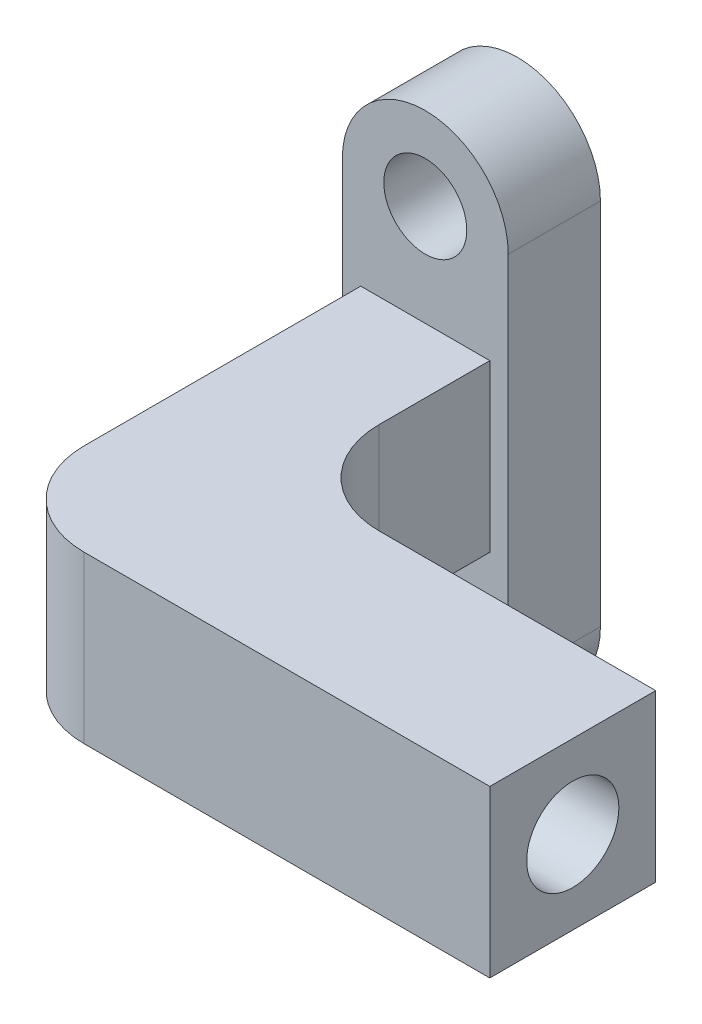
ISO-10303-21;
HEADER;
FILE_DESCRIPTION(('STEP AP214'),'2;1');
FILE_NAME('part.step','',(''),(''),'','','');
FILE_SCHEMA(('AUTOMOTIVE_DESIGN { 1 0 10303 214 1 1 1 1 }'));
ENDSEC;
DATA;
#1=APPLICATION_CONTEXT('core data for automotive mechanical design processes');
#2=APPLICATION_PROTOCOL_DEFINITION('international standard','automotive_design',2000,#1);
#3=PRODUCT_CONTEXT('',#1,'mechanical');
#4=PRODUCT('Part','Part','',(#3));
#5=PRODUCT_RELATED_PRODUCT_CATEGORY('part','',(#4));
#6=PRODUCT_DEFINITION_FORMATION('','',#4);
#7=PRODUCT_DEFINITION_CONTEXT('part definition',#1,'design');
#8=PRODUCT_DEFINITION('design','',#6,#7);
#9=PRODUCT_DEFINITION_SHAPE('','',#8);
#10=(LENGTH_UNIT() NAMED_UNIT(*) SI_UNIT(.MILLI.,.METRE.));
#11=(NAMED_UNIT(*) PLANE_ANGLE_UNIT() SI_UNIT($,.RADIAN.));
#12=(NAMED_UNIT(*) SI_UNIT($,.STERADIAN.) SOLID_ANGLE_UNIT());
#13=UNCERTAINTY_MEASURE_WITH_UNIT(LENGTH_MEASURE(1.E-05),#10,'distance_accuracy_value','');
#14=(GEOMETRIC_REPRESENTATION_CONTEXT(3) GLOBAL_UNCERTAINTY_ASSIGNED_CONTEXT((#13)) GLOBAL_UNIT_ASSIGNED_CONTEXT((#10,
#11,#12)) REPRESENTATION_CONTEXT('',''));
#15=CARTESIAN_POINT('',(0.,0.,0.));
#16=DIRECTION('',(0.,0.,1.));
#17=DIRECTION('',(1.,0.,0.));
#18=AXIS2_PLACEMENT_3D('',#15,#16,#17);
#19=CARTESIAN_POINT('',(3.5,-4.5,25.));
#20=DIRECTION('',(-1.,0.,0.));
#21=DIRECTION('',(0.,0.,1.));
#22=AXIS2_PLACEMENT_3D('',#19,#20,#21);
#23=PLANE('',#22);
#24=DIRECTION('',(0.,0.,-1.));
#25=VECTOR('',#24,1.);
#26=CARTESIAN_POINT('',(3.5,4.5,25.));
#27=LINE('',#26,#25);
#28=CARTESIAN_POINT('',(3.5,4.5,11.));
#29=VERTEX_POINT('',#28);
#30=CARTESIAN_POINT('',(3.5,4.5,5.));
#31=VERTEX_POINT('',#30);
#32=EDGE_CURVE('E223',#29,#31,#27,.T.);
#33=ORIENTED_EDGE('',*,*,#32,.F.);
#34=DIRECTION('',(0.,1.,0.));
#35=VECTOR('',#34,1.);
#36=CARTESIAN_POINT('',(3.5,-4.5,11.));
#37=LINE('',#36,#35);
#38=CARTESIAN_POINT('',(3.5,-4.5,11.));
#39=VERTEX_POINT('',#38);
#40=EDGE_CURVE('E272',#29,#39,#37,.F.);
#41=ORIENTED_EDGE('',*,*,#40,.T.);
#42=DIRECTION('',(0.,0.,-1.));
#43=VECTOR('',#42,1.);
#44=CARTESIAN_POINT('',(3.5,-4.5,25.));
#45=LINE('',#44,#43);
#46=CARTESIAN_POINT('',(3.5,-4.5,5.));
#47=VERTEX_POINT('',#46);
#48=EDGE_CURVE('E176',#39,#47,#45,.T.);
#49=ORIENTED_EDGE('',*,*,#48,.T.);
#50=DIRECTION('',(0.,1.,0.));
#51=VECTOR('',#50,1.);
#52=CARTESIAN_POINT('',(3.5,-4.5,5.));
#53=LINE('',#52,#51);
#54=EDGE_CURVE('E205',#47,#31,#53,.T.);
#55=ORIENTED_EDGE('',*,*,#54,.T.);
#56=EDGE_LOOP('',(#33,#41,#49,#55));
#57=FACE_BOUND('',#56,.T.);
#58=ADVANCED_FACE('F81',(#57),#23,.F.);
#59=CARTESIAN_POINT('',(0.,-10.,5.));
#60=DIRECTION('',(0.,0.,-1.));
#61=DIRECTION('',(-1.,0.,0.));
#62=AXIS2_PLACEMENT_3D('',#59,#60,#61);
#63=CYLINDRICAL_SURFACE('',#62,2.25);
#64=CARTESIAN_POINT('',(0.,-10.,5.));
#65=DIRECTION('',(0.,0.,1.));
#66=DIRECTION('',(1.,0.,0.));
#67=AXIS2_PLACEMENT_3D('',#64,#65,#66);
#68=CIRCLE('',#67,2.25);
#69=CARTESIAN_POINT('',(2.25,-10.,5.));
#70=VERTEX_POINT('',#69);
#71=EDGE_CURVE('E235',#70,#70,#68,.T.);
#72=ORIENTED_EDGE('',*,*,#71,.T.);
#73=EDGE_LOOP('',(#72));
#74=FACE_BOUND('',#73,.T.);
#75=CARTESIAN_POINT('',(0.,-10.,0.));
#76=DIRECTION('',(0.,0.,1.));
#77=DIRECTION('',(1.,0.,0.));
#78=AXIS2_PLACEMENT_3D('',#75,#76,#77);
#79=CIRCLE('',#78,2.25);
#80=CARTESIAN_POINT('',(2.25,-10.,0.));
#81=VERTEX_POINT('',#80);
#82=EDGE_CURVE('E230',#81,#81,#79,.T.);
#83=ORIENTED_EDGE('',*,*,#82,.F.);
#84=EDGE_LOOP('',(#83));
#85=FACE_BOUND('',#84,.T.);
#86=ADVANCED_FACE('F309',(#74,#85),#63,.F.);
#87=CARTESIAN_POINT('',(0.,-10.,5.));
#88=DIRECTION('',(0.,0.,-1.));
#89=DIRECTION('',(-1.,0.,0.));
#90=AXIS2_PLACEMENT_3D('',#87,#88,#89);
#91=CYLINDRICAL_SURFACE('',#90,4.5);
#92=CARTESIAN_POINT('',(0.,-10.,0.));
#93=DIRECTION('',(0.,0.,1.));
#94=DIRECTION('',(1.,0.,0.));
#95=AXIS2_PLACEMENT_3D('',#92,#93,#94);
#96=CIRCLE('',#95,4.5);
#97=CARTESIAN_POINT('',(-4.5,-10.,0.));
#98=VERTEX_POINT('',#97);
#99=CARTESIAN_POINT('',(4.5,-10.,0.));
#100=VERTEX_POINT('',#99);
#101=EDGE_CURVE('E242',#98,#100,#96,.T.);
#102=ORIENTED_EDGE('',*,*,#101,.T.);
#103=DIRECTION('',(0.,0.,-1.));
#104=VECTOR('',#103,1.);
#105=CARTESIAN_POINT('',(4.5,-10.,5.));
#106=LINE('',#105,#104);
#107=CARTESIAN_POINT('',(4.5,-10.,5.));
#108=VERTEX_POINT('',#107);
#109=EDGE_CURVE('E254',#108,#100,#106,.T.);
#110=ORIENTED_EDGE('',*,*,#109,.F.);
#111=CARTESIAN_POINT('',(0.,-10.,5.));
#112=DIRECTION('',(0.,0.,1.));
#113=DIRECTION('',(1.,0.,0.));
#114=AXIS2_PLACEMENT_3D('',#111,#112,#113);
#115=CIRCLE('',#114,4.5);
#116=CARTESIAN_POINT('',(-4.5,-10.,5.));
#117=VERTEX_POINT('',#116);
#118=EDGE_CURVE('E229',#117,#108,#115,.T.);
#119=ORIENTED_EDGE('',*,*,#118,.F.);
#120=DIRECTION('',(0.,0.,-1.));
#121=VECTOR('',#120,1.);
#122=CARTESIAN_POINT('',(-4.5,-10.,5.));
#123=LINE('',#122,#121);
#124=EDGE_CURVE('E256',#117,#98,#123,.T.);
#125=ORIENTED_EDGE('',*,*,#124,.T.);
#126=EDGE_LOOP('',(#102,#110,#119,#125));
#127=FACE_BOUND('',#126,.T.);
#128=ADVANCED_FACE('F316',(#127),#91,.T.);
#129=CARTESIAN_POINT('',(4.5,0.,5.));
#130=DIRECTION('',(1.,0.,0.));
#131=DIRECTION('',(0.,0.,-1.));
#132=AXIS2_PLACEMENT_3D('',#129,#130,#131);
#133=PLANE('',#132);
#134=DIRECTION('',(0.,-1.,0.));
#135=VECTOR('',#134,1.);
#136=CARTESIAN_POINT('',(4.5,0.,0.));
#137=LINE('',#136,#135);
#138=CARTESIAN_POINT('',(4.5,10.,0.));
#139=VERTEX_POINT('',#138);
#140=EDGE_CURVE('E246',#139,#100,#137,.T.);
#141=ORIENTED_EDGE('',*,*,#140,.F.);
#142=DIRECTION('',(0.,0.,-1.));
#143=VECTOR('',#142,1.);
#144=CARTESIAN_POINT('',(4.5,10.,5.));
#145=LINE('',#144,#143);
#146=CARTESIAN_POINT('',(4.5,10.,5.));
#147=VERTEX_POINT('',#146);
#148=EDGE_CURVE('E252',#147,#139,#145,.T.);
#149=ORIENTED_EDGE('',*,*,#148,.F.);
#150=DIRECTION('',(0.,-1.,0.));
#151=VECTOR('',#150,1.);
#152=CARTESIAN_POINT('',(4.5,0.,5.));
#153=LINE('',#152,#151);
#154=EDGE_CURVE('E232',#147,#108,#153,.T.);
#155=ORIENTED_EDGE('',*,*,#154,.T.);
#156=ORIENTED_EDGE('',*,*,#109,.T.);
#157=EDGE_LOOP('',(#141,#149,#155,#156));
#158=FACE_BOUND('',#157,.T.);
#159=ADVANCED_FACE('F331',(#158),#133,.T.);
#160=CARTESIAN_POINT('',(-4.5,0.,5.));
#161=DIRECTION('',(1.,0.,0.));
#162=DIRECTION('',(0.,0.,-1.));
#163=AXIS2_PLACEMENT_3D('',#160,#161,#162);
#164=PLANE('',#163);
#165=DIRECTION('',(0.,-1.,0.));
#166=VECTOR('',#165,1.);
#167=CARTESIAN_POINT('',(-4.5,0.,0.));
#168=LINE('',#167,#166);
#169=CARTESIAN_POINT('',(-4.5,10.,0.));
#170=VERTEX_POINT('',#169);
#171=EDGE_CURVE('E239',#170,#98,#168,.T.);
#172=ORIENTED_EDGE('',*,*,#171,.T.);
#173=ORIENTED_EDGE('',*,*,#124,.F.);
#174=DIRECTION('',(0.,-1.,0.));
#175=VECTOR('',#174,1.);
#176=CARTESIAN_POINT('',(-4.5,0.,5.));
#177=LINE('',#176,#175);
#178=CARTESIAN_POINT('',(-4.5,10.,5.));
#179=VERTEX_POINT('',#178);
#180=EDGE_CURVE('E226',#179,#117,#177,.T.);
#181=ORIENTED_EDGE('',*,*,#180,.F.);
#182=DIRECTION('',(0.,0.,-1.));
#183=VECTOR('',#182,1.);
#184=CARTESIAN_POINT('',(-4.5,10.,5.));
#185=LINE('',#184,#183);
#186=EDGE_CURVE('E238',#179,#170,#185,.T.);
#187=ORIENTED_EDGE('',*,*,#186,.T.);
#188=EDGE_LOOP('',(#172,#173,#181,#187));
#189=FACE_BOUND('',#188,.T.);
#190=ADVANCED_FACE('F328',(#189),#164,.F.);
#191=CARTESIAN_POINT('',(0.,0.,0.));
#192=DIRECTION('',(0.,0.,1.));
#193=DIRECTION('',(1.,0.,0.));
#194=AXIS2_PLACEMENT_3D('',#191,#192,#193);
#195=PLANE('',#194);
#196=ORIENTED_EDGE('',*,*,#171,.F.);
#197=CARTESIAN_POINT('',(0.,10.,0.));
#198=DIRECTION('',(0.,0.,1.));
#199=DIRECTION('',(1.,0.,0.));
#200=AXIS2_PLACEMENT_3D('',#197,#198,#199);
#201=CIRCLE('',#200,4.5);
#202=EDGE_CURVE('E263',#139,#170,#201,.T.);
#203=ORIENTED_EDGE('',*,*,#202,.F.);
#204=ORIENTED_EDGE('',*,*,#140,.T.);
#205=ORIENTED_EDGE('',*,*,#101,.F.);
#206=EDGE_LOOP('',(#196,#203,#204,#205));
#207=FACE_BOUND('',#206,.T.);
#208=ORIENTED_EDGE('',*,*,#82,.T.);
#209=EDGE_LOOP('',(#208));
#210=FACE_BOUND('',#209,.T.);
#211=CARTESIAN_POINT('',(0.,10.,0.));
#212=DIRECTION('',(0.,0.,1.));
#213=DIRECTION('',(1.,0.,0.));
#214=AXIS2_PLACEMENT_3D('',#211,#212,#213);
#215=CIRCLE('',#214,2.25);
#216=CARTESIAN_POINT('',(2.25,10.,0.));
#217=VERTEX_POINT('',#216);
#218=EDGE_CURVE('E225',#217,#217,#215,.T.);
#219=ORIENTED_EDGE('',*,*,#218,.T.);
#220=EDGE_LOOP('',(#219));
#221=FACE_BOUND('',#220,.T.);
#222=ADVANCED_FACE('F325',(#207,#210,#221),#195,.F.);
#223=CARTESIAN_POINT('',(0.,0.,5.));
#224=DIRECTION('',(0.,0.,1.));
#225=DIRECTION('',(1.,0.,0.));
#226=AXIS2_PLACEMENT_3D('',#223,#224,#225);
#227=PLANE('',#226);
#228=ORIENTED_EDGE('',*,*,#54,.F.);
#229=DIRECTION('',(1.,0.,0.));
#230=VECTOR('',#229,1.);
#231=CARTESIAN_POINT('',(-3.5,-4.5,5.));
#232=LINE('',#231,#230);
#233=CARTESIAN_POINT('',(-3.5,-4.5,5.));
#234=VERTEX_POINT('',#233);
#235=EDGE_CURVE('E206',#234,#47,#232,.T.);
#236=ORIENTED_EDGE('',*,*,#235,.F.);
#237=DIRECTION('',(0.,-1.,0.));
#238=VECTOR('',#237,1.);
#239=CARTESIAN_POINT('',(-3.5,-4.5,5.));
#240=LINE('',#239,#238);
#241=CARTESIAN_POINT('',(-3.5,4.5,5.));
#242=VERTEX_POINT('',#241);
#243=EDGE_CURVE('E213',#242,#234,#240,.T.);
#244=ORIENTED_EDGE('',*,*,#243,.F.);
#245=DIRECTION('',(-1.,0.,0.));
#246=VECTOR('',#245,1.);
#247=CARTESIAN_POINT('',(-3.5,4.5,5.));
#248=LINE('',#247,#246);
#249=EDGE_CURVE('E210',#31,#242,#248,.T.);
#250=ORIENTED_EDGE('',*,*,#249,.F.);
#251=EDGE_LOOP('',(#228,#236,#244,#250));
#252=FACE_BOUND('',#251,.T.);
#253=ORIENTED_EDGE('',*,*,#180,.T.);
#254=ORIENTED_EDGE('',*,*,#118,.T.);
#255=ORIENTED_EDGE('',*,*,#154,.F.);
#256=CARTESIAN_POINT('',(0.,10.,5.));
#257=DIRECTION('',(0.,0.,1.));
#258=DIRECTION('',(1.,0.,0.));
#259=AXIS2_PLACEMENT_3D('',#256,#257,#258);
#260=CIRCLE('',#259,4.5);
#261=EDGE_CURVE('E243',#147,#179,#260,.T.);
#262=ORIENTED_EDGE('',*,*,#261,.T.);
#263=EDGE_LOOP('',(#253,#254,#255,#262));
#264=FACE_BOUND('',#263,.T.);
#265=ORIENTED_EDGE('',*,*,#71,.F.);
#266=EDGE_LOOP('',(#265));
#267=FACE_BOUND('',#266,.T.);
#268=CARTESIAN_POINT('',(0.,10.,5.));
#269=DIRECTION('',(0.,0.,1.));
#270=DIRECTION('',(1.,0.,0.));
#271=AXIS2_PLACEMENT_3D('',#268,#269,#270);
#272=CIRCLE('',#271,2.25);
#273=CARTESIAN_POINT('',(2.25,10.,5.));
#274=VERTEX_POINT('',#273);
#275=EDGE_CURVE('E260',#274,#274,#272,.T.);
#276=ORIENTED_EDGE('',*,*,#275,.F.);
#277=EDGE_LOOP('',(#276));
#278=FACE_BOUND('',#277,.T.);
#279=ADVANCED_FACE('F296',(#252,#264,#267,#278),#227,.T.);
#280=CARTESIAN_POINT('',(0.,10.,5.));
#281=DIRECTION('',(0.,0.,-1.));
#282=DIRECTION('',(-1.,0.,0.));
#283=AXIS2_PLACEMENT_3D('',#280,#281,#282);
#284=CYLINDRICAL_SURFACE('',#283,2.25);
#285=ORIENTED_EDGE('',*,*,#275,.T.);
#286=EDGE_LOOP('',(#285));
#287=FACE_BOUND('',#286,.T.);
#288=ORIENTED_EDGE('',*,*,#218,.F.);
#289=EDGE_LOOP('',(#288));
#290=FACE_BOUND('',#289,.T.);
#291=ADVANCED_FACE('F324',(#287,#290),#284,.F.);
#292=CARTESIAN_POINT('',(0.,10.,5.));
#293=DIRECTION('',(0.,0.,-1.));
#294=DIRECTION('',(-1.,0.,0.));
#295=AXIS2_PLACEMENT_3D('',#292,#293,#294);
#296=CYLINDRICAL_SURFACE('',#295,4.5);
#297=ORIENTED_EDGE('',*,*,#202,.T.);
#298=ORIENTED_EDGE('',*,*,#186,.F.);
#299=ORIENTED_EDGE('',*,*,#261,.F.);
#300=ORIENTED_EDGE('',*,*,#148,.T.);
#301=EDGE_LOOP('',(#297,#298,#299,#300));
#302=FACE_BOUND('',#301,.T.);
#303=ADVANCED_FACE('F326',(#302),#296,.T.);
#304=CARTESIAN_POINT('',(-3.5,4.5,25.));
#305=DIRECTION('',(0.,-1.,0.));
#306=DIRECTION('',(0.,0.,-1.));
#307=AXIS2_PLACEMENT_3D('',#304,#305,#306);
#308=PLANE('',#307);
#309=DIRECTION('',(0.,0.,-1.));
#310=VECTOR('',#309,1.);
#311=CARTESIAN_POINT('',(-3.5,4.5,25.));
#312=LINE('',#311,#310);
#313=CARTESIAN_POINT('',(-3.5,4.5,20.));
#314=VERTEX_POINT('',#313);
#315=EDGE_CURVE('E221',#314,#242,#312,.T.);
#316=ORIENTED_EDGE('',*,*,#315,.F.);
#317=CARTESIAN_POINT('',(1.5,4.5,20.));
#318=DIRECTION('',(0.,-1.,0.));
#319=DIRECTION('',(0.,0.,-1.));
#320=AXIS2_PLACEMENT_3D('',#317,#318,#319);
#321=CIRCLE('',#320,5.);
#322=CARTESIAN_POINT('',(1.5,4.5,25.));
#323=VERTEX_POINT('',#322);
#324=EDGE_CURVE('E12',#314,#323,#321,.F.);
#325=ORIENTED_EDGE('',*,*,#324,.T.);
#326=DIRECTION('',(-1.,0.,0.));
#327=VECTOR('',#326,1.);
#328=CARTESIAN_POINT('',(-3.5,4.5,25.));
#329=LINE('',#328,#327);
#330=CARTESIAN_POINT('',(23.5,4.5,25.));
#331=VERTEX_POINT('',#330);
#332=EDGE_CURVE('E177',#331,#323,#329,.T.);
#333=ORIENTED_EDGE('',*,*,#332,.F.);
#334=DIRECTION('',(0.,0.,1.));
#335=VECTOR('',#334,1.);
#336=CARTESIAN_POINT('',(23.5,4.5,25.));
#337=LINE('',#336,#335);
#338=CARTESIAN_POINT('',(23.5,4.5,16.));
#339=VERTEX_POINT('',#338);
#340=EDGE_CURVE('E191',#339,#331,#337,.T.);
#341=ORIENTED_EDGE('',*,*,#340,.F.);
#342=DIRECTION('',(-1.,0.,0.));
#343=VECTOR('',#342,1.);
#344=CARTESIAN_POINT('',(23.5,4.5,16.));
#345=LINE('',#344,#343);
#346=CARTESIAN_POINT('',(8.5,4.5,16.));
#347=VERTEX_POINT('',#346);
#348=EDGE_CURVE('E201',#339,#347,#345,.T.);
#349=ORIENTED_EDGE('',*,*,#348,.T.);
#350=CARTESIAN_POINT('',(8.5,4.5,11.));
#351=DIRECTION('',(0.,-1.,0.));
#352=DIRECTION('',(0.,0.,-1.));
#353=AXIS2_PLACEMENT_3D('',#350,#351,#352);
#354=CIRCLE('',#353,5.);
#355=EDGE_CURVE('E274',#347,#29,#354,.T.);
#356=ORIENTED_EDGE('',*,*,#355,.T.);
#357=ORIENTED_EDGE('',*,*,#32,.T.);
#358=ORIENTED_EDGE('',*,*,#249,.T.);
#359=EDGE_LOOP('',(#316,#325,#333,#341,#349,#356,#357,#358));
#360=FACE_BOUND('',#359,.T.);
#361=ADVANCED_FACE('F290',(#360),#308,.F.);
#362=CARTESIAN_POINT('',(-3.5,-4.5,25.));
#363=DIRECTION('',(1.,0.,0.));
#364=DIRECTION('',(0.,0.,-1.));
#365=AXIS2_PLACEMENT_3D('',#362,#363,#364);
#366=PLANE('',#365);
#367=DIRECTION('',(0.,0.,-1.));
#368=VECTOR('',#367,1.);
#369=CARTESIAN_POINT('',(-3.5,-4.5,25.));
#370=LINE('',#369,#368);
#371=CARTESIAN_POINT('',(-3.5,-4.5,20.));
#372=VERTEX_POINT('',#371);
#373=EDGE_CURVE('E219',#372,#234,#370,.T.);
#374=ORIENTED_EDGE('',*,*,#373,.F.);
#375=DIRECTION('',(0.,-1.,0.));
#376=VECTOR('',#375,1.);
#377=CARTESIAN_POINT('',(-3.5,-4.5,20.));
#378=LINE('',#377,#376);
#379=EDGE_CURVE('E89',#372,#314,#378,.F.);
#380=ORIENTED_EDGE('',*,*,#379,.T.);
#381=ORIENTED_EDGE('',*,*,#315,.T.);
#382=ORIENTED_EDGE('',*,*,#243,.T.);
#383=EDGE_LOOP('',(#374,#380,#381,#382));
#384=FACE_BOUND('',#383,.T.);
#385=ADVANCED_FACE('F299',(#384),#366,.F.);
#386=CARTESIAN_POINT('',(-3.5,-4.5,25.));
#387=DIRECTION('',(0.,1.,0.));
#388=DIRECTION('',(0.,0.,1.));
#389=AXIS2_PLACEMENT_3D('',#386,#387,#388);
#390=PLANE('',#389);
#391=DIRECTION('',(1.,0.,0.));
#392=VECTOR('',#391,1.);
#393=CARTESIAN_POINT('',(-3.5,-4.5,25.));
#394=LINE('',#393,#392);
#395=CARTESIAN_POINT('',(1.5,-4.5,25.));
#396=VERTEX_POINT('',#395);
#397=CARTESIAN_POINT('',(23.5,-4.5,25.));
#398=VERTEX_POINT('',#397);
#399=EDGE_CURVE('E168',#396,#398,#394,.T.);
#400=ORIENTED_EDGE('',*,*,#399,.F.);
#401=CARTESIAN_POINT('',(1.5,-4.5,20.));
#402=DIRECTION('',(0.,1.,0.));
#403=DIRECTION('',(0.,0.,1.));
#404=AXIS2_PLACEMENT_3D('',#401,#402,#403);
#405=CIRCLE('',#404,5.);
#406=EDGE_CURVE('E103',#396,#372,#405,.F.);
#407=ORIENTED_EDGE('',*,*,#406,.T.);
#408=ORIENTED_EDGE('',*,*,#373,.T.);
#409=ORIENTED_EDGE('',*,*,#235,.T.);
#410=ORIENTED_EDGE('',*,*,#48,.F.);
#411=CARTESIAN_POINT('',(8.5,-4.5,11.));
#412=DIRECTION('',(0.,1.,0.));
#413=DIRECTION('',(0.,0.,1.));
#414=AXIS2_PLACEMENT_3D('',#411,#412,#413);
#415=CIRCLE('',#414,5.);
#416=CARTESIAN_POINT('',(8.5,-4.5,16.));
#417=VERTEX_POINT('',#416);
#418=EDGE_CURVE('E276',#39,#417,#415,.T.);
#419=ORIENTED_EDGE('',*,*,#418,.T.);
#420=DIRECTION('',(-1.,0.,0.));
#421=VECTOR('',#420,1.);
#422=CARTESIAN_POINT('',(23.5,-4.5,16.));
#423=LINE('',#422,#421);
#424=CARTESIAN_POINT('',(23.5,-4.5,16.));
#425=VERTEX_POINT('',#424);
#426=EDGE_CURVE('E183',#425,#417,#423,.T.);
#427=ORIENTED_EDGE('',*,*,#426,.F.);
#428=DIRECTION('',(0.,0.,-1.));
#429=VECTOR('',#428,1.);
#430=CARTESIAN_POINT('',(23.5,-4.5,25.));
#431=LINE('',#430,#429);
#432=EDGE_CURVE('E180',#398,#425,#431,.T.);
#433=ORIENTED_EDGE('',*,*,#432,.F.);
#434=EDGE_LOOP('',(#400,#407,#408,#409,#410,#419,#427,#433));
#435=FACE_BOUND('',#434,.T.);
#436=ADVANCED_FACE('F181',(#435),#390,.F.);
#437=CARTESIAN_POINT('',(0.,0.,25.));
#438=DIRECTION('',(0.,0.,-1.));
#439=DIRECTION('',(-1.,0.,0.));
#440=AXIS2_PLACEMENT_3D('',#437,#438,#439);
#441=PLANE('',#440);
#442=ORIENTED_EDGE('',*,*,#332,.T.);
#443=DIRECTION('',(0.,-1.,0.));
#444=VECTOR('',#443,1.);
#445=CARTESIAN_POINT('',(1.5,0.,25.));
#446=LINE('',#445,#444);
#447=EDGE_CURVE('E175',#323,#396,#446,.T.);
#448=ORIENTED_EDGE('',*,*,#447,.T.);
#449=ORIENTED_EDGE('',*,*,#399,.T.);
#450=DIRECTION('',(0.,-1.,0.));
#451=VECTOR('',#450,1.);
#452=CARTESIAN_POINT('',(23.5,4.5,25.));
#453=LINE('',#452,#451);
#454=EDGE_CURVE('E173',#331,#398,#453,.T.);
#455=ORIENTED_EDGE('',*,*,#454,.F.);
#456=EDGE_LOOP('',(#442,#448,#449,#455));
#457=FACE_BOUND('',#456,.T.);
#458=ADVANCED_FACE('F171',(#457),#441,.F.);
#459=CARTESIAN_POINT('',(23.5,4.5,16.));
#460=DIRECTION('',(0.,0.,1.));
#461=DIRECTION('',(1.,0.,0.));
#462=AXIS2_PLACEMENT_3D('',#459,#460,#461);
#463=PLANE('',#462);
#464=ORIENTED_EDGE('',*,*,#426,.T.);
#465=DIRECTION('',(0.,1.,0.));
#466=VECTOR('',#465,1.);
#467=CARTESIAN_POINT('',(8.5,4.5,16.));
#468=LINE('',#467,#466);
#469=EDGE_CURVE('E259',#417,#347,#468,.T.);
#470=ORIENTED_EDGE('',*,*,#469,.T.);
#471=ORIENTED_EDGE('',*,*,#348,.F.);
#472=DIRECTION('',(0.,1.,0.));
#473=VECTOR('',#472,1.);
#474=CARTESIAN_POINT('',(23.5,4.5,16.));
#475=LINE('',#474,#473);
#476=EDGE_CURVE('E186',#425,#339,#475,.T.);
#477=ORIENTED_EDGE('',*,*,#476,.F.);
#478=EDGE_LOOP('',(#464,#470,#471,#477));
#479=FACE_BOUND('',#478,.T.);
#480=ADVANCED_FACE('F285',(#479),#463,.F.);
#481=CARTESIAN_POINT('',(23.5,0.,0.));
#482=DIRECTION('',(1.,0.,0.));
#483=DIRECTION('',(0.,0.,-1.));
#484=AXIS2_PLACEMENT_3D('',#481,#482,#483);
#485=PLANE('',#484);
#486=CARTESIAN_POINT('',(23.5,0.,20.5));
#487=DIRECTION('',(1.,0.,0.));
#488=DIRECTION('',(0.,0.,-1.));
#489=AXIS2_PLACEMENT_3D('',#486,#487,#488);
#490=CIRCLE('',#489,2.5);
#491=CARTESIAN_POINT('',(23.5,0.,18.));
#492=VERTEX_POINT('',#491);
#493=EDGE_CURVE('E195',#492,#492,#490,.T.);
#494=ORIENTED_EDGE('',*,*,#493,.F.);
#495=EDGE_LOOP('',(#494));
#496=FACE_BOUND('',#495,.T.);
#497=ORIENTED_EDGE('',*,*,#454,.T.);
#498=ORIENTED_EDGE('',*,*,#432,.T.);
#499=ORIENTED_EDGE('',*,*,#476,.T.);
#500=ORIENTED_EDGE('',*,*,#340,.T.);
#501=EDGE_LOOP('',(#497,#498,#499,#500));
#502=FACE_BOUND('',#501,.T.);
#503=ADVANCED_FACE('F189',(#496,#502),#485,.T.);
#504=CARTESIAN_POINT('',(-1.5,0.,20.5));
#505=DIRECTION('',(1.,0.,0.));
#506=DIRECTION('',(0.,0.,-1.));
#507=AXIS2_PLACEMENT_3D('',#504,#505,#506);
#508=CYLINDRICAL_SURFACE('',#507,2.5);
#509=CARTESIAN_POINT('',(-1.5,0.,20.5));
#510=DIRECTION('',(1.,0.,0.));
#511=DIRECTION('',(0.,0.,-1.));
#512=AXIS2_PLACEMENT_3D('',#509,#510,#511);
#513=CIRCLE('',#512,2.5);
#514=CARTESIAN_POINT('',(-1.5,0.,18.));
#515=VERTEX_POINT('',#514);
#516=EDGE_CURVE('E192',#515,#515,#513,.T.);
#517=ORIENTED_EDGE('',*,*,#516,.F.);
#518=EDGE_LOOP('',(#517));
#519=FACE_BOUND('',#518,.T.);
#520=ORIENTED_EDGE('',*,*,#493,.T.);
#521=EDGE_LOOP('',(#520));
#522=FACE_BOUND('',#521,.T.);
#523=ADVANCED_FACE('F379',(#519,#522),#508,.F.);
#524=CARTESIAN_POINT('',(-1.5,0.,20.5));
#525=DIRECTION('',(1.,0.,0.));
#526=DIRECTION('',(0.,0.,-1.));
#527=AXIS2_PLACEMENT_3D('',#524,#525,#526);
#528=PLANE('',#527);
#529=ORIENTED_EDGE('',*,*,#516,.T.);
#530=EDGE_LOOP('',(#529));
#531=FACE_BOUND('',#530,.T.);
#532=ADVANCED_FACE('F307',(#531),#528,.T.);
#533=CARTESIAN_POINT('',(8.5,4.5,11.));
#534=DIRECTION('',(0.,-1.,0.));
#535=DIRECTION('',(0.,0.,-1.));
#536=AXIS2_PLACEMENT_3D('',#533,#534,#535);
#537=CYLINDRICAL_SURFACE('',#536,5.);
#538=ORIENTED_EDGE('',*,*,#418,.F.);
#539=ORIENTED_EDGE('',*,*,#40,.F.);
#540=ORIENTED_EDGE('',*,*,#355,.F.);
#541=ORIENTED_EDGE('',*,*,#469,.F.);
#542=EDGE_LOOP('',(#538,#539,#540,#541));
#543=FACE_BOUND('',#542,.T.);
#544=ADVANCED_FACE('F287',(#543),#537,.F.);
#545=CARTESIAN_POINT('',(1.5,0.,20.));
#546=DIRECTION('',(0.,-1.,0.));
#547=DIRECTION('',(0.,0.,-1.));
#548=AXIS2_PLACEMENT_3D('',#545,#546,#547);
#549=CYLINDRICAL_SURFACE('',#548,5.);
#550=ORIENTED_EDGE('',*,*,#324,.F.);
#551=ORIENTED_EDGE('',*,*,#379,.F.);
#552=ORIENTED_EDGE('',*,*,#406,.F.);
#553=ORIENTED_EDGE('',*,*,#447,.F.);
#554=EDGE_LOOP('',(#550,#551,#552,#553));
#555=FACE_BOUND('',#554,.T.);
#556=ADVANCED_FACE('F83',(#555),#549,.T.);
#557=CLOSED_SHELL('',(#58,#86,#128,#159,#190,#222,#279,#291,#303,#361,#385,#436,#458,#480,#503,
#523,#532,#544,#556));
#558=MANIFOLD_SOLID_BREP('B2',#557);
#559=ADVANCED_BREP_SHAPE_REPRESENTATION('',(#18,#558),#14);
#560=SHAPE_DEFINITION_REPRESENTATION(#9,#559);
ENDSEC;
END-ISO-10303-21;
